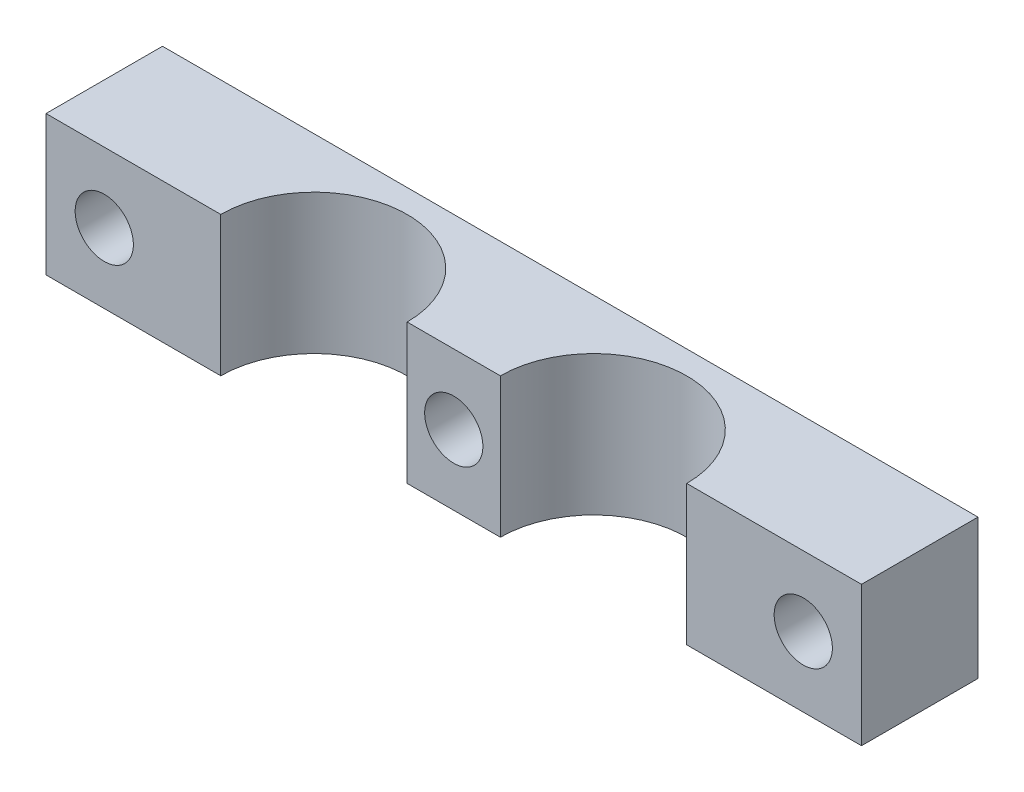
ISO-10303-21;
HEADER;
FILE_DESCRIPTION(('STEP AP214'),'2;1');
FILE_NAME('part.step','',(''),(''),'','','');
FILE_SCHEMA(('AUTOMOTIVE_DESIGN { 1 0 10303 214 1 1 1 1 }'));
ENDSEC;
DATA;
#1=APPLICATION_CONTEXT('core data for automotive mechanical design processes');
#2=APPLICATION_PROTOCOL_DEFINITION('international standard','automotive_design',2000,#1);
#3=PRODUCT_CONTEXT('',#1,'mechanical');
#4=PRODUCT('Part','Part','',(#3));
#5=PRODUCT_RELATED_PRODUCT_CATEGORY('part','',(#4));
#6=PRODUCT_DEFINITION_FORMATION('','',#4);
#7=PRODUCT_DEFINITION_CONTEXT('part definition',#1,'design');
#8=PRODUCT_DEFINITION('design','',#6,#7);
#9=PRODUCT_DEFINITION_SHAPE('','',#8);
#10=(LENGTH_UNIT() NAMED_UNIT(*) SI_UNIT(.MILLI.,.METRE.));
#11=(NAMED_UNIT(*) PLANE_ANGLE_UNIT() SI_UNIT($,.RADIAN.));
#12=(NAMED_UNIT(*) SI_UNIT($,.STERADIAN.) SOLID_ANGLE_UNIT());
#13=UNCERTAINTY_MEASURE_WITH_UNIT(LENGTH_MEASURE(1.E-05),#10,'distance_accuracy_value','');
#14=(GEOMETRIC_REPRESENTATION_CONTEXT(3) GLOBAL_UNCERTAINTY_ASSIGNED_CONTEXT((#13)) GLOBAL_UNIT_ASSIGNED_CONTEXT((#10,
#11,#12)) REPRESENTATION_CONTEXT('',''));
#15=CARTESIAN_POINT('',(0.,0.,0.));
#16=DIRECTION('',(0.,0.,1.));
#17=DIRECTION('',(1.,0.,0.));
#18=AXIS2_PLACEMENT_3D('',#15,#16,#17);
#19=CARTESIAN_POINT('',(12.,12.,5.));
#20=DIRECTION('',(0.,-1.,0.));
#21=DIRECTION('',(0.,0.,-1.));
#22=AXIS2_PLACEMENT_3D('',#19,#20,#21);
#23=CYLINDRICAL_SURFACE('',#22,8.);
#24=CARTESIAN_POINT('',(12.,0.,5.));
#25=DIRECTION('',(0.,1.,0.));
#26=DIRECTION('',(0.,0.,1.));
#27=AXIS2_PLACEMENT_3D('',#24,#25,#26);
#28=CIRCLE('',#27,8.);
#29=CARTESIAN_POINT('',(20.,0.,5.));
#30=VERTEX_POINT('',#29);
#31=CARTESIAN_POINT('',(4.,0.,5.));
#32=VERTEX_POINT('',#31);
#33=EDGE_CURVE('E142',#30,#32,#28,.T.);
#34=ORIENTED_EDGE('',*,*,#33,.F.);
#35=DIRECTION('',(0.,-1.,0.));
#36=VECTOR('',#35,1.);
#37=CARTESIAN_POINT('',(20.,12.,5.));
#38=LINE('',#37,#36);
#39=CARTESIAN_POINT('',(20.,12.,5.));
#40=VERTEX_POINT('',#39);
#41=EDGE_CURVE('E11',#40,#30,#38,.T.);
#42=ORIENTED_EDGE('',*,*,#41,.F.);
#43=CARTESIAN_POINT('',(12.,12.,5.));
#44=DIRECTION('',(0.,1.,0.));
#45=DIRECTION('',(0.,0.,1.));
#46=AXIS2_PLACEMENT_3D('',#43,#44,#45);
#47=CIRCLE('',#46,8.);
#48=CARTESIAN_POINT('',(4.,12.,5.));
#49=VERTEX_POINT('',#48);
#50=EDGE_CURVE('E200',#40,#49,#47,.T.);
#51=ORIENTED_EDGE('',*,*,#50,.T.);
#52=DIRECTION('',(0.,-1.,0.));
#53=VECTOR('',#52,1.);
#54=CARTESIAN_POINT('',(4.,12.,5.));
#55=LINE('',#54,#53);
#56=EDGE_CURVE('E92',#49,#32,#55,.T.);
#57=ORIENTED_EDGE('',*,*,#56,.T.);
#58=EDGE_LOOP('',(#34,#42,#51,#57));
#59=FACE_BOUND('',#58,.T.);
#60=ADVANCED_FACE('F41',(#59),#23,.F.);
#61=CARTESIAN_POINT('',(0.,12.,5.));
#62=DIRECTION('',(0.,0.,-1.));
#63=DIRECTION('',(-1.,0.,0.));
#64=AXIS2_PLACEMENT_3D('',#61,#62,#63);
#65=PLANE('',#64);
#66=CARTESIAN_POINT('',(30.,6.,5.));
#67=DIRECTION('',(0.,0.,-1.));
#68=DIRECTION('',(-1.,0.,0.));
#69=AXIS2_PLACEMENT_3D('',#66,#67,#68);
#70=CIRCLE('',#69,2.5);
#71=CARTESIAN_POINT('',(27.5,6.,5.));
#72=VERTEX_POINT('',#71);
#73=EDGE_CURVE('E211',#72,#72,#70,.F.);
#74=ORIENTED_EDGE('',*,*,#73,.F.);
#75=EDGE_LOOP('',(#74));
#76=FACE_BOUND('',#75,.T.);
#77=DIRECTION('',(1.,0.,0.));
#78=VECTOR('',#77,1.);
#79=CARTESIAN_POINT('',(0.,0.,5.));
#80=LINE('',#79,#78);
#81=CARTESIAN_POINT('',(35.,0.,5.));
#82=VERTEX_POINT('',#81);
#83=EDGE_CURVE('E146',#30,#82,#80,.T.);
#84=ORIENTED_EDGE('',*,*,#83,.T.);
#85=DIRECTION('',(0.,-1.,0.));
#86=VECTOR('',#85,1.);
#87=CARTESIAN_POINT('',(35.,12.,5.));
#88=LINE('',#87,#86);
#89=CARTESIAN_POINT('',(35.,12.,5.));
#90=VERTEX_POINT('',#89);
#91=EDGE_CURVE('E50',#90,#82,#88,.T.);
#92=ORIENTED_EDGE('',*,*,#91,.F.);
#93=DIRECTION('',(1.,0.,0.));
#94=VECTOR('',#93,1.);
#95=CARTESIAN_POINT('',(0.,12.,5.));
#96=LINE('',#95,#94);
#97=EDGE_CURVE('E123',#40,#90,#96,.T.);
#98=ORIENTED_EDGE('',*,*,#97,.F.);
#99=ORIENTED_EDGE('',*,*,#41,.T.);
#100=EDGE_LOOP('',(#84,#92,#98,#99));
#101=FACE_BOUND('',#100,.T.);
#102=ADVANCED_FACE('F187',(#76,#101),#65,.F.);
#103=CARTESIAN_POINT('',(35.,12.,0.));
#104=DIRECTION('',(1.,0.,0.));
#105=DIRECTION('',(0.,0.,-1.));
#106=AXIS2_PLACEMENT_3D('',#103,#104,#105);
#107=PLANE('',#106);
#108=DIRECTION('',(0.,0.,1.));
#109=VECTOR('',#108,1.);
#110=CARTESIAN_POINT('',(35.,0.,0.));
#111=LINE('',#110,#109);
#112=CARTESIAN_POINT('',(35.,0.,-5.));
#113=VERTEX_POINT('',#112);
#114=EDGE_CURVE('E151',#113,#82,#111,.T.);
#115=ORIENTED_EDGE('',*,*,#114,.F.);
#116=DIRECTION('',(0.,-1.,0.));
#117=VECTOR('',#116,1.);
#118=CARTESIAN_POINT('',(35.,12.,-5.));
#119=LINE('',#118,#117);
#120=CARTESIAN_POINT('',(35.,12.,-5.));
#121=VERTEX_POINT('',#120);
#122=EDGE_CURVE('E175',#121,#113,#119,.T.);
#123=ORIENTED_EDGE('',*,*,#122,.F.);
#124=DIRECTION('',(0.,0.,1.));
#125=VECTOR('',#124,1.);
#126=CARTESIAN_POINT('',(35.,12.,0.));
#127=LINE('',#126,#125);
#128=EDGE_CURVE('E184',#121,#90,#127,.T.);
#129=ORIENTED_EDGE('',*,*,#128,.T.);
#130=ORIENTED_EDGE('',*,*,#91,.T.);
#131=EDGE_LOOP('',(#115,#123,#129,#130));
#132=FACE_BOUND('',#131,.T.);
#133=ADVANCED_FACE('F182',(#132),#107,.T.);
#134=CARTESIAN_POINT('',(0.,12.,-5.));
#135=DIRECTION('',(0.,0.,-1.));
#136=DIRECTION('',(-1.,0.,0.));
#137=AXIS2_PLACEMENT_3D('',#134,#135,#136);
#138=PLANE('',#137);
#139=CARTESIAN_POINT('',(-30.,6.,-5.));
#140=DIRECTION('',(0.,0.,-1.));
#141=DIRECTION('',(-1.,0.,0.));
#142=AXIS2_PLACEMENT_3D('',#139,#140,#141);
#143=CIRCLE('',#142,2.50000000000001);
#144=CARTESIAN_POINT('',(-32.5,6.,-5.));
#145=VERTEX_POINT('',#144);
#146=EDGE_CURVE('E217',#145,#145,#143,.T.);
#147=ORIENTED_EDGE('',*,*,#146,.F.);
#148=EDGE_LOOP('',(#147));
#149=FACE_BOUND('',#148,.T.);
#150=CARTESIAN_POINT('',(30.,6.,-5.));
#151=DIRECTION('',(0.,0.,-1.));
#152=DIRECTION('',(-1.,0.,0.));
#153=AXIS2_PLACEMENT_3D('',#150,#151,#152);
#154=CIRCLE('',#153,2.5);
#155=CARTESIAN_POINT('',(27.5,6.,-5.));
#156=VERTEX_POINT('',#155);
#157=EDGE_CURVE('E216',#156,#156,#154,.T.);
#158=ORIENTED_EDGE('',*,*,#157,.F.);
#159=EDGE_LOOP('',(#158));
#160=FACE_BOUND('',#159,.T.);
#161=CARTESIAN_POINT('',(0.,6.,-5.));
#162=DIRECTION('',(0.,0.,-1.));
#163=DIRECTION('',(-1.,0.,0.));
#164=AXIS2_PLACEMENT_3D('',#161,#162,#163);
#165=CIRCLE('',#164,2.5);
#166=CARTESIAN_POINT('',(-2.5,6.,-5.));
#167=VERTEX_POINT('',#166);
#168=EDGE_CURVE('E207',#167,#167,#165,.T.);
#169=ORIENTED_EDGE('',*,*,#168,.F.);
#170=EDGE_LOOP('',(#169));
#171=FACE_BOUND('',#170,.T.);
#172=DIRECTION('',(1.,0.,0.));
#173=VECTOR('',#172,1.);
#174=CARTESIAN_POINT('',(0.,0.,-5.));
#175=LINE('',#174,#173);
#176=CARTESIAN_POINT('',(-35.,0.,-5.));
#177=VERTEX_POINT('',#176);
#178=EDGE_CURVE('E156',#177,#113,#175,.T.);
#179=ORIENTED_EDGE('',*,*,#178,.F.);
#180=DIRECTION('',(0.,-1.,0.));
#181=VECTOR('',#180,1.);
#182=CARTESIAN_POINT('',(-35.,12.,-5.));
#183=LINE('',#182,#181);
#184=CARTESIAN_POINT('',(-35.,12.,-5.));
#185=VERTEX_POINT('',#184);
#186=EDGE_CURVE('E172',#185,#177,#183,.T.);
#187=ORIENTED_EDGE('',*,*,#186,.F.);
#188=DIRECTION('',(1.,0.,0.));
#189=VECTOR('',#188,1.);
#190=CARTESIAN_POINT('',(0.,12.,-5.));
#191=LINE('',#190,#189);
#192=EDGE_CURVE('E195',#185,#121,#191,.T.);
#193=ORIENTED_EDGE('',*,*,#192,.T.);
#194=ORIENTED_EDGE('',*,*,#122,.T.);
#195=EDGE_LOOP('',(#179,#187,#193,#194));
#196=FACE_BOUND('',#195,.T.);
#197=ADVANCED_FACE('F193',(#149,#160,#171,#196),#138,.T.);
#198=CARTESIAN_POINT('',(-35.,12.,0.));
#199=DIRECTION('',(1.,0.,0.));
#200=DIRECTION('',(0.,0.,-1.));
#201=AXIS2_PLACEMENT_3D('',#198,#199,#200);
#202=PLANE('',#201);
#203=DIRECTION('',(0.,0.,1.));
#204=VECTOR('',#203,1.);
#205=CARTESIAN_POINT('',(-35.,0.,0.));
#206=LINE('',#205,#204);
#207=CARTESIAN_POINT('',(-35.,0.,5.));
#208=VERTEX_POINT('',#207);
#209=EDGE_CURVE('E160',#177,#208,#206,.T.);
#210=ORIENTED_EDGE('',*,*,#209,.T.);
#211=DIRECTION('',(0.,-1.,0.));
#212=VECTOR('',#211,1.);
#213=CARTESIAN_POINT('',(-35.,12.,5.));
#214=LINE('',#213,#212);
#215=CARTESIAN_POINT('',(-35.,12.,5.));
#216=VERTEX_POINT('',#215);
#217=EDGE_CURVE('E133',#216,#208,#214,.T.);
#218=ORIENTED_EDGE('',*,*,#217,.F.);
#219=DIRECTION('',(0.,0.,1.));
#220=VECTOR('',#219,1.);
#221=CARTESIAN_POINT('',(-35.,12.,0.));
#222=LINE('',#221,#220);
#223=EDGE_CURVE('E117',#185,#216,#222,.T.);
#224=ORIENTED_EDGE('',*,*,#223,.F.);
#225=ORIENTED_EDGE('',*,*,#186,.T.);
#226=EDGE_LOOP('',(#210,#218,#224,#225));
#227=FACE_BOUND('',#226,.T.);
#228=ADVANCED_FACE('F232',(#227),#202,.F.);
#229=CARTESIAN_POINT('',(-30.,6.,5.));
#230=DIRECTION('',(0.,0.,-1.));
#231=DIRECTION('',(-1.,0.,0.));
#232=AXIS2_PLACEMENT_3D('',#229,#230,#231);
#233=CIRCLE('',#232,2.50000000000001);
#234=CARTESIAN_POINT('',(-32.5,6.,5.));
#235=VERTEX_POINT('',#234);
#236=EDGE_CURVE('E212',#235,#235,#233,.F.);
#237=ORIENTED_EDGE('',*,*,#236,.F.);
#238=EDGE_LOOP('',(#237));
#239=FACE_BOUND('',#238,.T.);
#240=CARTESIAN_POINT('',(-20.,0.,5.));
#241=VERTEX_POINT('',#240);
#242=EDGE_CURVE('E128',#208,#241,#80,.T.);
#243=ORIENTED_EDGE('',*,*,#242,.T.);
#244=DIRECTION('',(0.,-1.,0.));
#245=VECTOR('',#244,1.);
#246=CARTESIAN_POINT('',(-20.,12.,5.));
#247=LINE('',#246,#245);
#248=CARTESIAN_POINT('',(-20.,12.,5.));
#249=VERTEX_POINT('',#248);
#250=EDGE_CURVE('E125',#249,#241,#247,.T.);
#251=ORIENTED_EDGE('',*,*,#250,.F.);
#252=EDGE_CURVE('E110',#216,#249,#96,.T.);
#253=ORIENTED_EDGE('',*,*,#252,.F.);
#254=ORIENTED_EDGE('',*,*,#217,.T.);
#255=EDGE_LOOP('',(#243,#251,#253,#254));
#256=FACE_BOUND('',#255,.T.);
#257=ADVANCED_FACE('F126',(#239,#256),#65,.F.);
#258=CARTESIAN_POINT('',(-12.,12.,5.));
#259=DIRECTION('',(0.,-1.,0.));
#260=DIRECTION('',(0.,0.,-1.));
#261=AXIS2_PLACEMENT_3D('',#258,#259,#260);
#262=CYLINDRICAL_SURFACE('',#261,8.);
#263=CARTESIAN_POINT('',(-12.,0.,5.));
#264=DIRECTION('',(0.,1.,0.));
#265=DIRECTION('',(0.,0.,1.));
#266=AXIS2_PLACEMENT_3D('',#263,#264,#265);
#267=CIRCLE('',#266,8.);
#268=CARTESIAN_POINT('',(-4.,0.,5.));
#269=VERTEX_POINT('',#268);
#270=EDGE_CURVE('E163',#269,#241,#267,.T.);
#271=ORIENTED_EDGE('',*,*,#270,.F.);
#272=DIRECTION('',(0.,-1.,0.));
#273=VECTOR('',#272,1.);
#274=CARTESIAN_POINT('',(-4.,12.,5.));
#275=LINE('',#274,#273);
#276=CARTESIAN_POINT('',(-4.,12.,5.));
#277=VERTEX_POINT('',#276);
#278=EDGE_CURVE('E85',#277,#269,#275,.T.);
#279=ORIENTED_EDGE('',*,*,#278,.F.);
#280=CARTESIAN_POINT('',(-12.,12.,5.));
#281=DIRECTION('',(0.,1.,0.));
#282=DIRECTION('',(0.,0.,1.));
#283=AXIS2_PLACEMENT_3D('',#280,#281,#282);
#284=CIRCLE('',#283,8.);
#285=EDGE_CURVE('E114',#277,#249,#284,.T.);
#286=ORIENTED_EDGE('',*,*,#285,.T.);
#287=ORIENTED_EDGE('',*,*,#250,.T.);
#288=EDGE_LOOP('',(#271,#279,#286,#287));
#289=FACE_BOUND('',#288,.T.);
#290=ADVANCED_FACE('F135',(#289),#262,.F.);
#291=CARTESIAN_POINT('',(0.,6.,5.));
#292=DIRECTION('',(0.,0.,-1.));
#293=DIRECTION('',(-1.,0.,0.));
#294=AXIS2_PLACEMENT_3D('',#291,#292,#293);
#295=CIRCLE('',#294,2.5);
#296=CARTESIAN_POINT('',(-2.5,6.,5.));
#297=VERTEX_POINT('',#296);
#298=EDGE_CURVE('E147',#297,#297,#295,.F.);
#299=ORIENTED_EDGE('',*,*,#298,.F.);
#300=EDGE_LOOP('',(#299));
#301=FACE_BOUND('',#300,.T.);
#302=EDGE_CURVE('E152',#269,#32,#80,.T.);
#303=ORIENTED_EDGE('',*,*,#302,.T.);
#304=ORIENTED_EDGE('',*,*,#56,.F.);
#305=EDGE_CURVE('E58',#277,#49,#96,.T.);
#306=ORIENTED_EDGE('',*,*,#305,.F.);
#307=ORIENTED_EDGE('',*,*,#278,.T.);
#308=EDGE_LOOP('',(#303,#304,#306,#307));
#309=FACE_BOUND('',#308,.T.);
#310=ADVANCED_FACE('F256',(#301,#309),#65,.F.);
#311=CARTESIAN_POINT('',(0.,12.,0.));
#312=DIRECTION('',(0.,1.,0.));
#313=DIRECTION('',(0.,0.,1.));
#314=AXIS2_PLACEMENT_3D('',#311,#312,#313);
#315=PLANE('',#314);
#316=ORIENTED_EDGE('',*,*,#50,.F.);
#317=ORIENTED_EDGE('',*,*,#97,.T.);
#318=ORIENTED_EDGE('',*,*,#128,.F.);
#319=ORIENTED_EDGE('',*,*,#192,.F.);
#320=ORIENTED_EDGE('',*,*,#223,.T.);
#321=ORIENTED_EDGE('',*,*,#252,.T.);
#322=ORIENTED_EDGE('',*,*,#285,.F.);
#323=ORIENTED_EDGE('',*,*,#305,.T.);
#324=EDGE_LOOP('',(#316,#317,#318,#319,#320,#321,#322,#323));
#325=FACE_BOUND('',#324,.T.);
#326=ADVANCED_FACE('F112',(#325),#315,.T.);
#327=CARTESIAN_POINT('',(0.,0.,0.));
#328=DIRECTION('',(0.,1.,0.));
#329=DIRECTION('',(0.,0.,1.));
#330=AXIS2_PLACEMENT_3D('',#327,#328,#329);
#331=PLANE('',#330);
#332=ORIENTED_EDGE('',*,*,#33,.T.);
#333=ORIENTED_EDGE('',*,*,#302,.F.);
#334=ORIENTED_EDGE('',*,*,#270,.T.);
#335=ORIENTED_EDGE('',*,*,#242,.F.);
#336=ORIENTED_EDGE('',*,*,#209,.F.);
#337=ORIENTED_EDGE('',*,*,#178,.T.);
#338=ORIENTED_EDGE('',*,*,#114,.T.);
#339=ORIENTED_EDGE('',*,*,#83,.F.);
#340=EDGE_LOOP('',(#332,#333,#334,#335,#336,#337,#338,#339));
#341=FACE_BOUND('',#340,.T.);
#342=ADVANCED_FACE('F189',(#341),#331,.F.);
#343=CARTESIAN_POINT('',(0.,6.,12.0710678118655));
#344=DIRECTION('',(0.,0.,-1.));
#345=DIRECTION('',(-1.,0.,0.));
#346=AXIS2_PLACEMENT_3D('',#343,#344,#345);
#347=CYLINDRICAL_SURFACE('',#346,2.5);
#348=ORIENTED_EDGE('',*,*,#298,.T.);
#349=EDGE_LOOP('',(#348));
#350=FACE_BOUND('',#349,.T.);
#351=ORIENTED_EDGE('',*,*,#168,.T.);
#352=EDGE_LOOP('',(#351));
#353=FACE_BOUND('',#352,.T.);
#354=ADVANCED_FACE('F237',(#350,#353),#347,.F.);
#355=CARTESIAN_POINT('',(-30.,6.,12.0710678118655));
#356=DIRECTION('',(0.,0.,-1.));
#357=DIRECTION('',(-1.,0.,0.));
#358=AXIS2_PLACEMENT_3D('',#355,#356,#357);
#359=CYLINDRICAL_SURFACE('',#358,2.50000000000001);
#360=ORIENTED_EDGE('',*,*,#236,.T.);
#361=EDGE_LOOP('',(#360));
#362=FACE_BOUND('',#361,.T.);
#363=ORIENTED_EDGE('',*,*,#146,.T.);
#364=EDGE_LOOP('',(#363));
#365=FACE_BOUND('',#364,.T.);
#366=ADVANCED_FACE('F239',(#362,#365),#359,.F.);
#367=CARTESIAN_POINT('',(30.,6.,12.0710678118655));
#368=DIRECTION('',(0.,0.,-1.));
#369=DIRECTION('',(-1.,0.,0.));
#370=AXIS2_PLACEMENT_3D('',#367,#368,#369);
#371=CYLINDRICAL_SURFACE('',#370,2.5);
#372=ORIENTED_EDGE('',*,*,#73,.T.);
#373=EDGE_LOOP('',(#372));
#374=FACE_BOUND('',#373,.T.);
#375=ORIENTED_EDGE('',*,*,#157,.T.);
#376=EDGE_LOOP('',(#375));
#377=FACE_BOUND('',#376,.T.);
#378=ADVANCED_FACE('F228',(#374,#377),#371,.F.);
#379=CLOSED_SHELL('',(#60,#102,#133,#197,#228,#257,#290,#310,#326,#342,#354,#366,#378));
#380=MANIFOLD_SOLID_BREP('B2',#379);
#381=ADVANCED_BREP_SHAPE_REPRESENTATION('',(#18,#380),#14);
#382=SHAPE_DEFINITION_REPRESENTATION(#9,#381);
ENDSEC;
END-ISO-10303-21;
